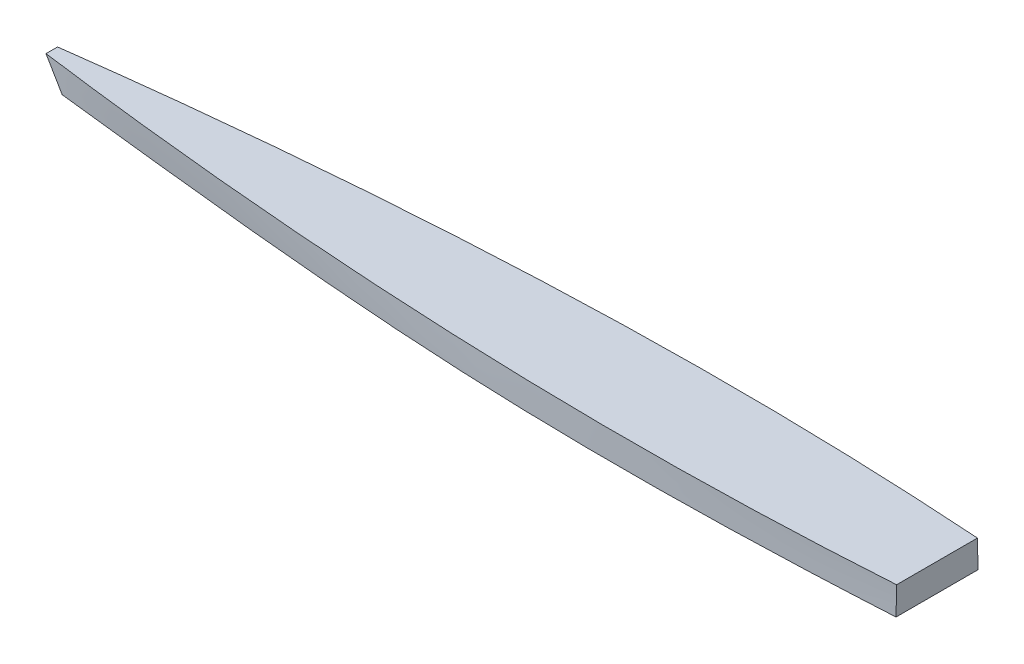
ISO-10303-21;
HEADER;
FILE_DESCRIPTION(('STEP AP214'),'2;1');
FILE_NAME('part.step','',(''),(''),'','','');
FILE_SCHEMA(('AUTOMOTIVE_DESIGN { 1 0 10303 214 1 1 1 1 }'));
ENDSEC;
DATA;
#1=APPLICATION_CONTEXT('core data for automotive mechanical design processes');
#2=APPLICATION_PROTOCOL_DEFINITION('international standard','automotive_design',2000,#1);
#3=PRODUCT_CONTEXT('',#1,'mechanical');
#4=PRODUCT('Part','Part','',(#3));
#5=PRODUCT_RELATED_PRODUCT_CATEGORY('part','',(#4));
#6=PRODUCT_DEFINITION_FORMATION('','',#4);
#7=PRODUCT_DEFINITION_CONTEXT('part definition',#1,'design');
#8=PRODUCT_DEFINITION('design','',#6,#7);
#9=PRODUCT_DEFINITION_SHAPE('','',#8);
#10=(LENGTH_UNIT() NAMED_UNIT(*) SI_UNIT(.MILLI.,.METRE.));
#11=(NAMED_UNIT(*) PLANE_ANGLE_UNIT() SI_UNIT($,.RADIAN.));
#12=(NAMED_UNIT(*) SI_UNIT($,.STERADIAN.) SOLID_ANGLE_UNIT());
#13=UNCERTAINTY_MEASURE_WITH_UNIT(LENGTH_MEASURE(1.E-05),#10,'distance_accuracy_value','');
#14=(GEOMETRIC_REPRESENTATION_CONTEXT(3) GLOBAL_UNCERTAINTY_ASSIGNED_CONTEXT((#13)) GLOBAL_UNIT_ASSIGNED_CONTEXT((#10,
#11,#12)) REPRESENTATION_CONTEXT('',''));
#15=CARTESIAN_POINT('',(0.,0.,0.));
#16=DIRECTION('',(0.,0.,1.));
#17=DIRECTION('',(1.,0.,0.));
#18=AXIS2_PLACEMENT_3D('',#15,#16,#17);
#19=CARTESIAN_POINT('',(0.,76.099248554247,0.));
#20=DIRECTION('',(0.,1.,0.));
#21=DIRECTION('',(-1.,0.,0.));
#22=AXIS2_PLACEMENT_3D('',#19,#20,#21);
#23=PLANE('',#22);
#24=DIRECTION('',(0.,0.,1.));
#25=VECTOR('',#24,1.);
#26=CARTESIAN_POINT('',(553.780953203146,76.099248554247,55.5625006612436));
#27=LINE('',#26,#25);
#28=CARTESIAN_POINT('',(553.780953203146,76.0992485949757,-56.2915010822734));
#29=VERTEX_POINT('',#28);
#30=CARTESIAN_POINT('',(553.780953203146,76.0992485949757,56.2915024047605));
#31=VERTEX_POINT('',#30);
#32=EDGE_CURVE('E105',#29,#31,#27,.T.);
#33=ORIENTED_EDGE('',*,*,#32,.T.);
#34=CARTESIAN_POINT('',(553.780953203146,76.0992485542447,56.2915012475109));
#35=CARTESIAN_POINT('',(548.691400627242,76.0992485542462,56.5843476116765));
#36=CARTESIAN_POINT('',(543.601578538204,76.0992485542468,56.872495332768));
#37=CARTESIAN_POINT('',(533.42139187593,76.0992485542472,57.4390655724165));
#38=CARTESIAN_POINT('',(528.331027302553,76.0992485542471,57.7174880884207));
#39=CARTESIAN_POINT('',(513.059138934226,76.0992485542468,58.5376746390057));
#40=CARTESIAN_POINT('',(502.876800238232,76.099248554247,59.0643588440932));
#41=CARTESIAN_POINT('',(482.509373835073,76.099248554247,60.0752241969458));
#42=CARTESIAN_POINT('',(472.324285995726,76.099248554247,60.559402682073));
#43=CARTESIAN_POINT('',(451.952054602145,76.099248554247,61.4831775400791));
#44=CARTESIAN_POINT('',(441.764911041685,76.099248554247,61.9227737758264));
#45=CARTESIAN_POINT('',(421.386834624233,76.099248554247,62.7556221357843));
#46=CARTESIAN_POINT('',(411.195901414873,76.099248554247,63.1488656627537));
#47=CARTESIAN_POINT('',(390.812290076746,76.099248554247,63.8872411190141));
#48=CARTESIAN_POINT('',(380.619611946188,76.099248554247,64.2323729985718));
#49=CARTESIAN_POINT('',(350.039169140624,76.099248554247,65.1932449936613));
#50=CARTESIAN_POINT('',(329.648997550896,76.099248554247,65.734461403871));
#51=CARTESIAN_POINT('',(288.864101811881,76.099248554247,66.6065235577172));
#52=CARTESIAN_POINT('',(268.46937764818,76.099248554247,66.9373686254923));
#53=CARTESIAN_POINT('',(227.677430989963,76.099248554247,67.3774165039712));
#54=CARTESIAN_POINT('',(207.280208495252,76.099248554247,67.4866192973405));
#55=CARTESIAN_POINT('',(176.68294336357,76.099248554247,67.4753824401243));
#56=CARTESIAN_POINT('',(166.482807832377,76.099248554247,67.4424537633486));
#57=CARTESIAN_POINT('',(146.082883191789,76.099248554247,67.3166805643712));
#58=CARTESIAN_POINT('',(135.883094082687,76.099248554247,67.223835992727));
#59=CARTESIAN_POINT('',(115.484271123353,76.099248554247,66.9766373364144));
#60=CARTESIAN_POINT('',(105.285237272344,76.099248554247,66.8222833158709));
#61=CARTESIAN_POINT('',(84.88831930552,76.099248554247,66.4504177205375));
#62=CARTESIAN_POINT('',(74.6904351896736,76.099248554247,66.2329061474204));
#63=CARTESIAN_POINT('',(54.2965786959706,76.099248554247,65.7330448601313));
#64=CARTESIAN_POINT('',(44.1006062663914,76.099248554247,65.4506972722968));
#65=CARTESIAN_POINT('',(28.8082033618935,76.099248554247,64.9772680944497));
#66=CARTESIAN_POINT('',(23.7109896849912,76.099248554247,64.811140202569));
#67=CARTESIAN_POINT('',(13.5171372945412,76.099248554247,64.4620317215511));
#68=CARTESIAN_POINT('',(8.42049858099535,76.099248554247,64.2790511323539));
#69=CARTESIAN_POINT('',(-1.77212926356476,76.099248554247,63.8960435043117));
#70=CARTESIAN_POINT('',(-6.86811839568757,76.099248554247,63.6960164949566));
#71=CARTESIAN_POINT('',(-17.0593870551233,76.099248554247,63.2786467067865));
#72=CARTESIAN_POINT('',(-22.1546665825278,76.099248554247,63.0613039302081));
#73=CARTESIAN_POINT('',(-32.3444496181157,76.099248554247,62.6094701535389));
#74=CARTESIAN_POINT('',(-37.4389531285939,76.099248554247,62.3749792051854));
#75=CARTESIAN_POINT('',(-47.6271636743454,76.099248554247,61.8892741757567));
#76=CARTESIAN_POINT('',(-52.7208707093056,76.099248554247,61.6380600881229));
#77=CARTESIAN_POINT('',(-64.6045885664099,76.099248554247,61.0328535881577));
#78=CARTESIAN_POINT('',(-71.3942767439341,76.099248554247,60.6725064092039));
#79=CARTESIAN_POINT('',(-84.9721000907269,76.099248554247,59.9237013622475));
#80=CARTESIAN_POINT('',(-91.7602352592213,76.099248554247,59.5352434802614));
#81=CARTESIAN_POINT('',(-112.122276244407,76.099248554247,58.3291365391262));
#82=CARTESIAN_POINT('',(-125.693787544524,76.099248554247,57.4707557208354));
#83=CARTESIAN_POINT('',(-152.830046928349,76.099248554247,55.6532816993014));
#84=CARTESIAN_POINT('',(-166.394795001874,76.099248554247,54.6941883448642));
#85=CARTESIAN_POINT('',(-193.517885762236,76.099248554247,52.6833671846185));
#86=CARTESIAN_POINT('',(-207.076228209098,76.099248554247,51.6316361482157));
#87=CARTESIAN_POINT('',(-234.186038127279,76.099248554247,49.4438045453874));
#88=CARTESIAN_POINT('',(-247.73750562208,76.099248554247,48.3077042691125));
#89=CARTESIAN_POINT('',(-274.833800085622,76.099248554247,45.9594250948926));
#90=CARTESIAN_POINT('',(-288.37862707112,76.099248554247,44.7472463899437));
#91=CARTESIAN_POINT('',(-312.073690832685,76.099248554247,42.5669016631304));
#92=CARTESIAN_POINT('',(-322.225297969657,76.099248554247,41.6135713970536));
#93=CARTESIAN_POINT('',(-342.525177543365,76.099248554247,39.6723162401581));
#94=CARTESIAN_POINT('',(-352.673449988122,76.099248554247,38.6843914331629));
#95=CARTESIAN_POINT('',(-372.966633599849,76.099248554247,36.677477574366));
#96=CARTESIAN_POINT('',(-383.111544852488,76.099248554247,35.6584893876679));
#97=CARTESIAN_POINT('',(-403.398562038219,76.099248554247,33.5929367458321));
#98=CARTESIAN_POINT('',(-413.54066796962,76.099248554247,32.5463722740995));
#99=CARTESIAN_POINT('',(-441.763701959852,76.099248554247,29.6002106743659));
#100=CARTESIAN_POINT('',(-459.841894209587,76.099248554247,27.6744072617789));
#101=CARTESIAN_POINT('',(-495.99236470605,76.099248554247,23.7666559149249));
#102=CARTESIAN_POINT('',(-514.064642891466,76.099248554247,21.7847074161523));
#103=CARTESIAN_POINT('',(-541.170350037351,76.0992485542469,18.7856043200811));
#104=CARTESIAN_POINT('',(-550.205231234944,76.0992485542469,17.7815289553796));
#105=CARTESIAN_POINT('',(-568.274334846362,76.099248554247,15.7674624944378));
#106=CARTESIAN_POINT('',(-577.308557260146,76.0992485542471,14.7574713978251));
#107=CARTESIAN_POINT('',(-595.376531738266,76.0992485542469,12.7344790524697));
#108=CARTESIAN_POINT('',(-604.410283807528,76.0992485542465,11.7214778476461));
#109=CARTESIAN_POINT('',(-622.477793344397,76.0992485542474,9.69554588120248));
#110=CARTESIAN_POINT('',(-631.511550812002,76.0992485542486,8.68261511956341));
#111=CARTESIAN_POINT('',(-640.545485727815,76.0992485542515,7.67126689882748));
#112=B_SPLINE_CURVE_WITH_KNOTS('',3,(#34,#35,#36,#37,#38,#39,#40,#41,#42,#43,#44,#45,#46,#47,
#48,#49,#50,#51,#52,#53,#54,#55,#56,#57,#58,#59,#60,#61,#62,#63,#64,#65,#66,#67,#68,#69,#70,#71,
#72,#73,#74,#75,#76,#77,#78,#79,#80,#81,#82,#83,#84,#85,#86,#87,#88,#89,#90,#91,#92,#93,#94,#95,
#96,#97,#98,#99,#100,#101,#102,#103,#104,#105,#106,#107,#108,#109,#110,#111),.UNSPECIFIED.,.F.,
.F.,(4,2,2,2,2,2,2,2,2,2,2,2,2,2,2,2,2,2,2,2,2,2,2,2,2,2,2,2,2,2,2,2,2,2,2,2,2,2,4),(0.,
15.2939076420012,30.5878192984548,61.1755817522859,91.7652589156075,122.355030167592,
152.950466141388,183.545933741638,244.736873443255,305.928009732392,367.119150807245,
397.71957292551,428.320020295291,458.920435763564,489.520850421305,520.120261662646,
535.419999297464,550.719736986754,566.019448208354,581.319157453712,596.618820540631,
611.918489627901,632.316155322379,652.713831163632,693.5092729502,734.304775981517,
775.101702255892,815.898488233773,856.695170722365,887.283927618339,917.872610402175,
948.460442079436,979.048292164186,1033.58958573166,1088.13142787448,1115.4029356555,
1142.67444515289,1169.94555867975,1197.21666476381),.UNSPECIFIED.);
#113=CARTESIAN_POINT('',(-640.545485728992,76.0992485562892,7.67126708149292));
#114=VERTEX_POINT('',#113);
#115=EDGE_CURVE('E103',#31,#114,#112,.T.);
#116=ORIENTED_EDGE('',*,*,#115,.T.);
#117=DIRECTION('',(0.,0.,-1.));
#118=VECTOR('',#117,1.);
#119=CARTESIAN_POINT('',(-640.545485727813,76.099248554247,5.95312566124175));
#120=LINE('',#119,#118);
#121=CARTESIAN_POINT('',(-640.545485728991,76.0992485562891,-7.67126575900572));
#122=VERTEX_POINT('',#121);
#123=EDGE_CURVE('E93',#114,#122,#120,.T.);
#124=ORIENTED_EDGE('',*,*,#123,.T.);
#125=CARTESIAN_POINT('',(-640.545485727318,76.0992485538189,-7.67126557632745));
#126=CARTESIAN_POINT('',(-632.416945888742,76.0992485540933,-8.58124736623067));
#127=CARTESIAN_POINT('',(-624.288550710013,76.0992485542058,-9.49251952293756));
#128=CARTESIAN_POINT('',(-608.031787523571,76.0992485542882,-11.3153751926665));
#129=CARTESIAN_POINT('',(-599.903419515891,76.099248554258,-12.2269587059801));
#130=CARTESIAN_POINT('',(-583.64646142175,76.0992485542359,-14.0481662591641));
#131=CARTESIAN_POINT('',(-575.517871335225,76.099248554244,-14.9577902984652));
#132=CARTESIAN_POINT('',(-559.260556566068,76.0992485542499,-16.7729077085187));
#133=CARTESIAN_POINT('',(-551.131831901608,76.0992485542478,-17.678401241915));
#134=CARTESIAN_POINT('',(-534.873700932175,76.0992485542462,-19.4832345195766));
#135=CARTESIAN_POINT('',(-526.744294627377,76.0992485542468,-20.3825742654325));
#136=CARTESIAN_POINT('',(-510.484583404626,76.0992485542472,-22.1731127668738));
#137=CARTESIAN_POINT('',(-502.354278486466,76.099248554247,-23.0643115206021));
#138=CARTESIAN_POINT('',(-482.027019672258,76.0992485542468,-25.2797231633218));
#139=CARTESIAN_POINT('',(-469.829377736764,76.0992485542469,-26.5976366416079));
#140=CARTESIAN_POINT('',(-445.430991449372,76.099248554247,-29.2044221997818));
#141=CARTESIAN_POINT('',(-433.230247098709,76.099248554247,-30.4932942912132));
#142=CARTESIAN_POINT('',(-408.824422798524,76.099248554247,-33.035844907156));
#143=CARTESIAN_POINT('',(-396.619342651411,76.099248554247,-34.2895215385971));
#144=CARTESIAN_POINT('',(-372.20495977332,76.099248554247,-36.7554640934822));
#145=CARTESIAN_POINT('',(-359.995657029993,76.099248554247,-37.9677298947556));
#146=CARTESIAN_POINT('',(-331.496928439449,76.099248554247,-40.7413823055425));
#147=CARTESIAN_POINT('',(-315.205693233277,76.099248554247,-42.2842606059902));
#148=CARTESIAN_POINT('',(-282.614080293706,76.099248554247,-45.2709939602072));
#149=CARTESIAN_POINT('',(-266.313702537428,76.099248554247,-46.7148487650523));
#150=CARTESIAN_POINT('',(-233.703163408372,76.099248554247,-49.4890627639229));
#151=CARTESIAN_POINT('',(-217.393001979667,76.099248554247,-50.8194213028274));
#152=CARTESIAN_POINT('',(-184.764219800344,76.099248554247,-53.3520943459828));
#153=CARTESIAN_POINT('',(-168.445599973031,76.099248554247,-54.5544206970066));
#154=CARTESIAN_POINT('',(-135.798523754923,76.099248554247,-56.8169334357098));
#155=CARTESIAN_POINT('',(-119.470067390074,76.099248554247,-57.8771201967025));
#156=CARTESIAN_POINT('',(-86.8038290985314,76.099248554247,-59.841467850722));
#157=CARTESIAN_POINT('',(-70.4660472553001,76.099248554247,-60.7456301188667));
#158=CARTESIAN_POINT('',(-47.8067620497793,76.099248554247,-61.8819676558373));
#159=CARTESIAN_POINT('',(-41.4888169369225,76.099248554247,-62.1861271075655));
#160=CARTESIAN_POINT('',(-28.8517248128534,76.099248554247,-62.7684117416635));
#161=CARTESIAN_POINT('',(-22.5325778023496,76.099248554247,-63.0465369393316));
#162=CARTESIAN_POINT('',(-9.89312387632621,76.099248554247,-63.5761014801569));
#163=CARTESIAN_POINT('',(-3.57281695337738,76.099248554247,-63.8275406459559));
#164=CARTESIAN_POINT('',(9.06878407646942,76.099248554247,-64.3041739551129));
#165=CARTESIAN_POINT('',(15.3900781836576,76.099248554247,-64.5293680907419));
#166=CARTESIAN_POINT('',(34.3553250089056,76.099248554247,-65.1661700031595));
#167=CARTESIAN_POINT('',(47.0006003082084,76.099248554247,-65.5389955344384));
#168=CARTESIAN_POINT('',(72.2936784405487,76.099248554247,-66.1844884637536));
#169=CARTESIAN_POINT('',(84.9414812729978,76.099248554247,-66.4571558850792));
#170=CARTESIAN_POINT('',(110.240879087103,76.099248554247,-66.905591232992));
#171=CARTESIAN_POINT('',(122.892474350407,76.099248554247,-67.0813432365107));
#172=CARTESIAN_POINT('',(148.196586393023,76.099248554247,-67.3390059072936));
#173=CARTESIAN_POINT('',(160.849103170449,76.099248554247,-67.4209167615271));
#174=CARTESIAN_POINT('',(186.154388253573,76.099248554247,-67.4938976955659));
#175=CARTESIAN_POINT('',(198.807156559194,76.099248554247,-67.4849678024976));
#176=CARTESIAN_POINT('',(224.11227290533,76.099248554247,-67.3791394357279));
#177=CARTESIAN_POINT('',(236.764620947197,76.099248554247,-67.2822412797962));
#178=CARTESIAN_POINT('',(262.108994899266,76.099248554247,-67.0027959071827));
#179=CARTESIAN_POINT('',(274.801017769487,76.099248554247,-66.8199746841074));
#180=CARTESIAN_POINT('',(300.183567701022,76.099248554247,-66.3713155181747));
#181=CARTESIAN_POINT('',(312.874094764942,76.099248554247,-66.105477722129));
#182=CARTESIAN_POINT('',(338.253262456628,76.099248554247,-65.4935169653743));
#183=CARTESIAN_POINT('',(350.941903075928,76.099248554247,-65.1473936546556));
#184=CARTESIAN_POINT('',(376.316909322625,76.099248554247,-64.3776721954713));
#185=CARTESIAN_POINT('',(389.003274935091,76.099248554247,-63.9540735558955));
#186=CARTESIAN_POINT('',(414.368950863335,76.099248554247,-63.0325480898213));
#187=CARTESIAN_POINT('',(427.048262107769,76.099248554247,-62.5346467517782));
#188=CARTESIAN_POINT('',(452.403854766845,76.099248554247,-61.4676724388544));
#189=CARTESIAN_POINT('',(465.080136189721,76.099248554247,-60.8985996596511));
#190=CARTESIAN_POINT('',(484.092048706821,76.099248554247,-59.9943895624507));
#191=CARTESIAN_POINT('',(490.428894876092,76.099248554247,-59.6845548104425));
#192=CARTESIAN_POINT('',(503.101769369279,76.099248554247,-59.048537053948));
#193=CARTESIAN_POINT('',(509.437797693056,76.099248554247,-58.7223540466879));
#194=CARTESIAN_POINT('',(522.10883803718,76.099248554247,-58.0541984731401));
#195=CARTESIAN_POINT('',(528.443850081495,76.099248554247,-57.7122263607672));
#196=CARTESIAN_POINT('',(541.113032674255,76.099248554247,-57.0130979041289));
#197=CARTESIAN_POINT('',(547.447203223203,76.099248554247,-56.6559415690011));
#198=CARTESIAN_POINT('',(553.780953203146,76.099248554247,-56.2914999250235));
#199=B_SPLINE_CURVE_WITH_KNOTS('',3,(#125,#126,#127,#128,#129,#130,#131,#132,#133,#134,#135,
#136,#137,#138,#139,#140,#141,#142,#143,#144,#145,#146,#147,#148,#149,#150,#151,#152,#153,#154,
#155,#156,#157,#158,#159,#160,#161,#162,#163,#164,#165,#166,#167,#168,#169,#170,#171,#172,#173,
#174,#175,#176,#177,#178,#179,#180,#181,#182,#183,#184,#185,#186,#187,#188,#189,#190,#191,#192,
#193,#194,#195,#196,#197,#198),.UNSPECIFIED.,.F.,.F.,(4,2,2,2,2,2,2,2,2,2,2,2,2,2,2,2,2,2,2,2,2,
2,2,2,2,2,2,2,2,2,2,2,2,2,2,2,4),(0.,24.5379507600793,49.0759245551283,73.6139054789095,
98.1509117000488,122.687911578482,147.224917054155,184.030788874651,220.836646065035,
257.644479166342,294.452420848968,343.544551237017,392.636805027853,441.729342168903,
490.817332840582,539.905194585779,588.992623674277,607.96837052227,626.944106219793,
645.919968024259,664.895835416962,702.847696075509,740.799547909201,778.757633322914,
816.715643108729,854.67364155976,892.631502894798,930.711240819928,968.790911402847,
1006.87074799958,1044.95082598985,1083.01787106572,1121.08481148311,1140.11804296008,
1159.15127766638,1178.18396553381,1197.21664194784),.UNSPECIFIED.);
#200=EDGE_CURVE('E100',#122,#29,#199,.T.);
#201=ORIENTED_EDGE('',*,*,#200,.T.);
#202=EDGE_LOOP('',(#33,#116,#124,#201));
#203=FACE_BOUND('',#202,.T.);
#204=ADVANCED_FACE('F39',(#203),#23,.F.);
#205=CARTESIAN_POINT('',(553.780953203146,11.0117485542469,55.5625006612436));
#206=DIRECTION('',(1.,0.,0.));
#207=DIRECTION('',(0.,0.,-1.));
#208=AXIS2_PLACEMENT_3D('',#205,#206,#207);
#209=PLANE('',#208);
#210=ORIENTED_EDGE('',*,*,#32,.F.);
#211=CARTESIAN_POINT('',(553.780953203146,-12.8007514457532,6.61243597210876E-07));
#212=CARTESIAN_POINT('',(553.780953203146,-12.8007514457532,-74.0833326720897));
#213=CARTESIAN_POINT('',(553.780953203146,8.36591522091353,-55.5624993387564));
#214=CARTESIAN_POINT('',(553.780953203146,114.199248554247,-55.5624993387564));
#215=B_SPLINE_CURVE_WITH_KNOTS('',3,(#211,#212,#213,#214),.UNSPECIFIED.,.F.,.F.,(4,4),(0.,1.),.UNSPECIFIED.);
#216=CARTESIAN_POINT('',(553.780953203146,114.199248554247,-55.5624993387564));
#217=VERTEX_POINT('',#216);
#218=EDGE_CURVE('E182',#29,#217,#215,.T.);
#219=ORIENTED_EDGE('',*,*,#218,.T.);
#220=DIRECTION('',(0.,0.,1.));
#221=VECTOR('',#220,1.);
#222=CARTESIAN_POINT('',(553.780953203146,114.199248554247,-55.5624993387564));
#223=LINE('',#222,#221);
#224=CARTESIAN_POINT('',(553.780953203146,114.199248554247,6.61243597210876E-07));
#225=VERTEX_POINT('',#224);
#226=EDGE_CURVE('E221',#217,#225,#223,.T.);
#227=ORIENTED_EDGE('',*,*,#226,.T.);
#228=DIRECTION('',(0.,0.,-1.));
#229=VECTOR('',#228,1.);
#230=CARTESIAN_POINT('',(553.780953203146,114.199248554247,55.5625006612436));
#231=LINE('',#230,#229);
#232=CARTESIAN_POINT('',(553.780953203146,114.199248554247,55.5625006612436));
#233=VERTEX_POINT('',#232);
#234=EDGE_CURVE('E252',#233,#225,#231,.T.);
#235=ORIENTED_EDGE('',*,*,#234,.F.);
#236=CARTESIAN_POINT('',(553.780953203146,-12.8007514457532,6.61243597210876E-07));
#237=CARTESIAN_POINT('',(553.780953203146,-12.8007514457532,74.0833339945769));
#238=CARTESIAN_POINT('',(553.780953203146,8.36591522091353,55.5625006612436));
#239=CARTESIAN_POINT('',(553.780953203146,114.199248554247,55.5625006612436));
#240=B_SPLINE_CURVE_WITH_KNOTS('',3,(#236,#237,#238,#239),.UNSPECIFIED.,.F.,.F.,(4,4),(0.,1.),.UNSPECIFIED.);
#241=EDGE_CURVE('E176',#31,#233,#240,.T.);
#242=ORIENTED_EDGE('',*,*,#241,.F.);
#243=EDGE_LOOP('',(#210,#219,#227,#235,#242));
#244=FACE_BOUND('',#243,.T.);
#245=ADVANCED_FACE('F189',(#244),#209,.T.);
#246=CARTESIAN_POINT('',(553.780953203146,114.199248554247,55.5625006612436));
#247=DIRECTION('',(0.,1.,0.));
#248=DIRECTION('',(0.,0.,-1.));
#249=AXIS2_PLACEMENT_3D('',#246,#247,#248);
#250=PLANE('',#249);
#251=CARTESIAN_POINT('',(553.780953203146,114.199248554247,-55.5624993387564));
#252=CARTESIAN_POINT('',(362.885905135831,114.199248554247,-68.2977025756679));
#253=CARTESIAN_POINT('',(-24.9367782549931,114.199248554247,-73.3539114446648));
#254=CARTESIAN_POINT('',(-447.996417655558,114.199248554247,-36.5477025756679));
#255=CARTESIAN_POINT('',(-662.542530983938,114.199248554247,-7.9374993387564));
#256=B_SPLINE_CURVE_WITH_KNOTS('',3,(#251,#252,#253,#254,#255),.UNSPECIFIED.,.F.,.F.,(4,1,4),
(0.,0.48021814139568,1.),.UNSPECIFIED.);
#257=CARTESIAN_POINT('',(-662.542530983938,114.199248554247,-7.9374993387564));
#258=VERTEX_POINT('',#257);
#259=EDGE_CURVE('E211',#258,#217,#256,.F.);
#260=ORIENTED_EDGE('',*,*,#259,.F.);
#261=DIRECTION('',(0.,0.,-1.));
#262=VECTOR('',#261,1.);
#263=CARTESIAN_POINT('',(-662.542530983938,114.199248554247,-7.9374993387564));
#264=LINE('',#263,#262);
#265=CARTESIAN_POINT('',(-662.542530983938,114.199248554247,6.61243597210876E-07));
#266=VERTEX_POINT('',#265);
#267=EDGE_CURVE('E58',#266,#258,#264,.T.);
#268=ORIENTED_EDGE('',*,*,#267,.F.);
#269=DIRECTION('',(0.,0.,1.));
#270=VECTOR('',#269,1.);
#271=CARTESIAN_POINT('',(-662.542530983938,114.199248554247,7.9375006612436));
#272=LINE('',#271,#270);
#273=CARTESIAN_POINT('',(-662.542530983938,114.199248554247,7.9375006612436));
#274=VERTEX_POINT('',#273);
#275=EDGE_CURVE('E11',#266,#274,#272,.T.);
#276=ORIENTED_EDGE('',*,*,#275,.T.);
#277=CARTESIAN_POINT('',(553.780953203146,114.199248554247,55.5625006612436));
#278=CARTESIAN_POINT('',(362.885905135831,114.199248554247,68.297703898155));
#279=CARTESIAN_POINT('',(-24.9367782549931,114.199248554247,73.3539127671519));
#280=CARTESIAN_POINT('',(-447.996417655558,114.199248554247,36.5477038981551));
#281=CARTESIAN_POINT('',(-662.542530983938,114.199248554247,7.93750066124359));
#282=B_SPLINE_CURVE_WITH_KNOTS('',3,(#277,#278,#279,#280,#281),.UNSPECIFIED.,.F.,.F.,(4,1,4),
(0.,0.48021814139568,1.),.UNSPECIFIED.);
#283=EDGE_CURVE('E67',#274,#233,#282,.F.);
#284=ORIENTED_EDGE('',*,*,#283,.T.);
#285=ORIENTED_EDGE('',*,*,#234,.T.);
#286=ORIENTED_EDGE('',*,*,#226,.F.);
#287=EDGE_LOOP('',(#260,#268,#276,#284,#285,#286));
#288=FACE_BOUND('',#287,.T.);
#289=ADVANCED_FACE('F137',(#288),#250,.T.);
#290=CARTESIAN_POINT('',(553.780953203146,-12.8007514457532,6.61243597210876E-07));
#291=CARTESIAN_POINT('',(363.280953203146,-23.3840847790864,6.61243554911379E-07));
#292=CARTESIAN_POINT('',(-47.9138628846482,-33.984010045265,6.61243512545567E-07));
#293=CARTESIAN_POINT('',(-398.719046796854,-23.3840847790864,6.61243554911379E-07));
#294=CARTESIAN_POINT('',(-589.219046796854,-12.8007514457532,6.61243597210876E-07));
#295=CARTESIAN_POINT('',(553.780953203146,-12.8007514457532,74.0833339945769));
#296=CARTESIAN_POINT('',(363.149270514041,-19.8563070013087,78.328401740214));
#297=CARTESIAN_POINT('',(-51.5452336226101,-37.5228491116064,77.9584223003413));
#298=CARTESIAN_POINT('',(-390.703675687394,-19.8563070013087,14.8284017402141));
#299=CARTESIAN_POINT('',(-589.219046796854,-12.8007514457532,5.29166732791026));
#300=CARTESIAN_POINT('',(553.780953203146,8.36591522091353,55.5625006612436));
#301=CARTESIAN_POINT('',(363.017587824936,4.83813744313578,64.0526361525179));
#302=CARTESIAN_POINT('',(-40.8609521324241,39.2867906570279,80.0567339290442));
#303=CARTESIAN_POINT('',(-413.678455431684,37.347986589387,27.0109694858512));
#304=CARTESIAN_POINT('',(-620.209197650604,40.8757643671648,7.9375006612436));
#305=CARTESIAN_POINT('',(553.780953203146,114.199248554247,55.5625006612436));
#306=CARTESIAN_POINT('',(362.885905135831,114.199248554247,68.2977038981551));
#307=CARTESIAN_POINT('',(-24.9367782549931,114.199248554247,73.353912767152));
#308=CARTESIAN_POINT('',(-447.996417655558,114.199248554247,36.5477038981551));
#309=CARTESIAN_POINT('',(-662.542530983938,114.199248554247,7.9375006612436));
#310=B_SPLINE_SURFACE_WITH_KNOTS('',3,3,((#290,#291,#292,#293,#294),(#295,#296,#297,#298,#299),
(#300,#301,#302,#303,#304),(#305,#306,#307,#308,#309)),.UNSPECIFIED.,.F.,.F.,.F.,(4,4),(4,1,4),
(0.,1.),(0.,0.48021814139568,1.),.UNSPECIFIED.);
#311=CARTESIAN_POINT('',(-662.542530983938,114.199248554247,7.9375006612436));
#312=CARTESIAN_POINT('',(-620.209197650604,40.8757643671648,7.9375006612436));
#313=CARTESIAN_POINT('',(-589.219046796854,-12.8007514457532,5.29166732791026));
#314=CARTESIAN_POINT('',(-589.219046796854,-12.8007514457532,6.61243597210876E-07));
#315=B_SPLINE_CURVE_WITH_KNOTS('',3,(#311,#312,#313,#314),.UNSPECIFIED.,.F.,.F.,(4,4),(0.,1.),.UNSPECIFIED.);
#316=EDGE_CURVE('E51',#274,#114,#315,.T.);
#317=ORIENTED_EDGE('',*,*,#115,.F.);
#318=ORIENTED_EDGE('',*,*,#241,.T.);
#319=ORIENTED_EDGE('',*,*,#283,.F.);
#320=ORIENTED_EDGE('',*,*,#316,.T.);
#321=EDGE_LOOP('',(#317,#318,#319,#320));
#322=FACE_BOUND('',#321,.T.);
#323=ADVANCED_FACE('F109',(#322),#310,.T.);
#324=CARTESIAN_POINT('',(553.780953203146,-12.8007514457532,6.61243597210876E-07));
#325=CARTESIAN_POINT('',(363.280953203146,-23.3840847790864,6.61243639510374E-07));
#326=CARTESIAN_POINT('',(-47.9138628846482,-33.984010045265,6.61243681876185E-07));
#327=CARTESIAN_POINT('',(-398.719046796854,-23.3840847790864,6.61243639510374E-07));
#328=CARTESIAN_POINT('',(-589.219046796854,-12.8007514457532,6.61243597210876E-07));
#329=CARTESIAN_POINT('',(553.780953203146,-12.8007514457532,-74.0833326720897));
#330=CARTESIAN_POINT('',(363.149270514041,-19.8563070013087,-78.3284004177268));
#331=CARTESIAN_POINT('',(-51.5452336226101,-37.5228491116064,-77.9584209778541));
#332=CARTESIAN_POINT('',(-390.703675687394,-19.8563070013087,-14.8284004177269));
#333=CARTESIAN_POINT('',(-589.219046796854,-12.8007514457532,-5.29166600542307));
#334=CARTESIAN_POINT('',(553.780953203146,8.36591522091353,-55.5624993387564));
#335=CARTESIAN_POINT('',(363.017587824936,4.83813744313578,-64.0526348300307));
#336=CARTESIAN_POINT('',(-40.8609521324241,39.2867906570279,-80.056732606557));
#337=CARTESIAN_POINT('',(-413.678455431684,37.347986589387,-27.010968163364));
#338=CARTESIAN_POINT('',(-620.209197650604,40.8757643671648,-7.9374993387564));
#339=CARTESIAN_POINT('',(553.780953203146,114.199248554247,-55.5624993387564));
#340=CARTESIAN_POINT('',(362.885905135831,114.199248554247,-68.2977025756679));
#341=CARTESIAN_POINT('',(-24.9367782549931,114.199248554247,-73.3539114446648));
#342=CARTESIAN_POINT('',(-447.996417655558,114.199248554247,-36.5477025756679));
#343=CARTESIAN_POINT('',(-662.542530983938,114.199248554247,-7.9374993387564));
#344=B_SPLINE_SURFACE_WITH_KNOTS('',3,3,((#324,#325,#326,#327,#328),(#329,#330,#331,#332,#333),
(#334,#335,#336,#337,#338),(#339,#340,#341,#342,#343)),.UNSPECIFIED.,.F.,.F.,.F.,(4,4),(4,1,4),
(0.,1.),(0.,0.48021814139568,1.),.UNSPECIFIED.);
#345=CARTESIAN_POINT('',(-662.542530983938,114.199248554247,-7.9374993387564));
#346=CARTESIAN_POINT('',(-620.209197650604,40.8757643671648,-7.9374993387564));
#347=CARTESIAN_POINT('',(-589.219046796854,-12.8007514457532,-5.29166600542307));
#348=CARTESIAN_POINT('',(-589.219046796854,-12.8007514457532,6.61243597210876E-07));
#349=B_SPLINE_CURVE_WITH_KNOTS('',3,(#345,#346,#347,#348),.UNSPECIFIED.,.F.,.F.,(4,4),(0.,1.),.UNSPECIFIED.);
#350=EDGE_CURVE('E97',#258,#122,#349,.T.);
#351=ORIENTED_EDGE('',*,*,#200,.F.);
#352=ORIENTED_EDGE('',*,*,#350,.F.);
#353=ORIENTED_EDGE('',*,*,#259,.T.);
#354=ORIENTED_EDGE('',*,*,#218,.F.);
#355=EDGE_LOOP('',(#351,#352,#353,#354));
#356=FACE_BOUND('',#355,.T.);
#357=ADVANCED_FACE('F136',(#356),#344,.F.);
#358=CARTESIAN_POINT('',(-610.005788890396,23.2029419840911,5.9531256612436));
#359=DIRECTION('',(-0.866025403784437,-0.500000000000003,0.));
#360=DIRECTION('',(0.500000000000003,-0.866025403784437,0.));
#361=AXIS2_PLACEMENT_3D('',#358,#359,#360);
#362=PLANE('',#361);
#363=ORIENTED_EDGE('',*,*,#123,.F.);
#364=ORIENTED_EDGE('',*,*,#316,.F.);
#365=ORIENTED_EDGE('',*,*,#275,.F.);
#366=ORIENTED_EDGE('',*,*,#267,.T.);
#367=ORIENTED_EDGE('',*,*,#350,.T.);
#368=EDGE_LOOP('',(#363,#364,#365,#366,#367));
#369=FACE_BOUND('',#368,.T.);
#370=ADVANCED_FACE('F41',(#369),#362,.T.);
#371=CLOSED_SHELL('',(#204,#245,#289,#323,#357,#370));
#372=MANIFOLD_SOLID_BREP('B2',#371);
#373=ADVANCED_BREP_SHAPE_REPRESENTATION('',(#18,#372),#14);
#374=SHAPE_DEFINITION_REPRESENTATION(#9,#373);
ENDSEC;
END-ISO-10303-21;
